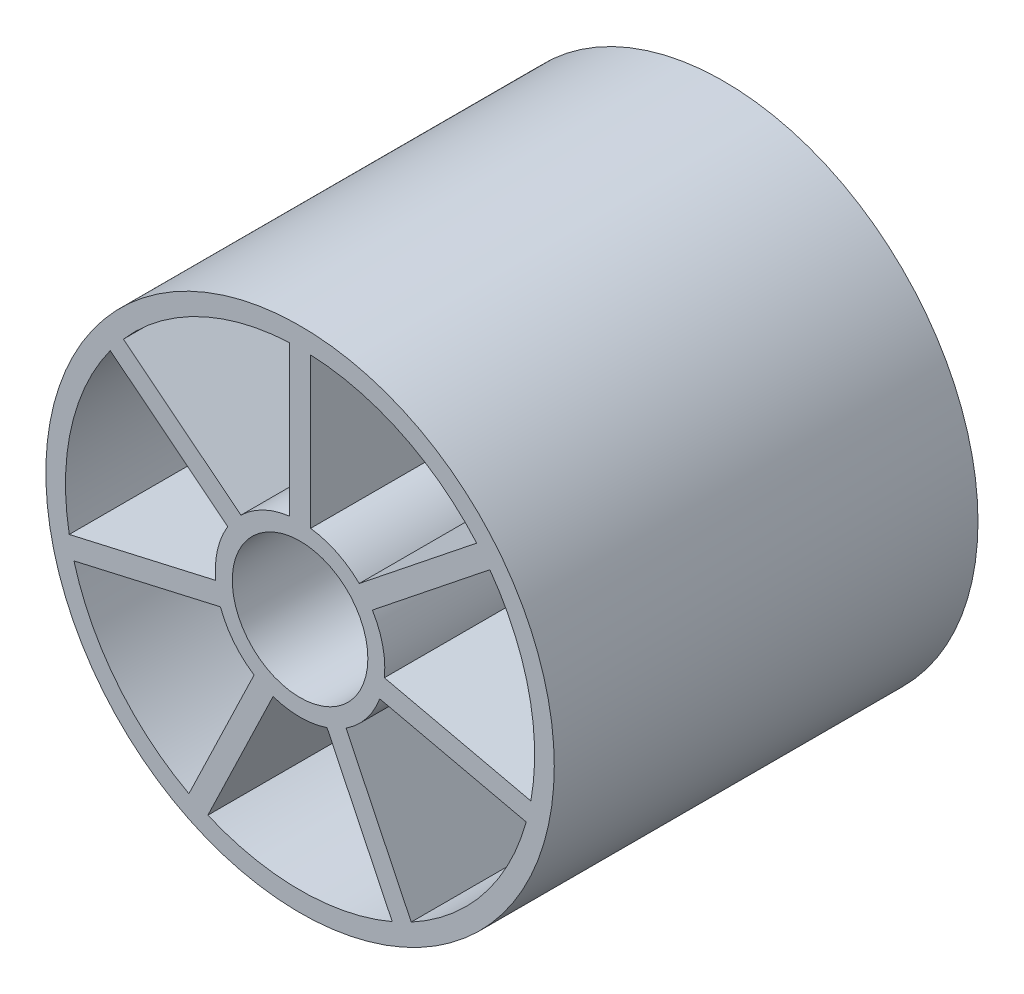
ISO-10303-21;
HEADER;
FILE_DESCRIPTION(('STEP AP214'),'2;1');
FILE_NAME('part.step','',(''),(''),'','','');
FILE_SCHEMA(('AUTOMOTIVE_DESIGN { 1 0 10303 214 1 1 1 1 }'));
ENDSEC;
DATA;
#1=APPLICATION_CONTEXT('core data for automotive mechanical design processes');
#2=APPLICATION_PROTOCOL_DEFINITION('international standard','automotive_design',2000,#1);
#3=PRODUCT_CONTEXT('',#1,'mechanical');
#4=PRODUCT('Part','Part','',(#3));
#5=PRODUCT_RELATED_PRODUCT_CATEGORY('part','',(#4));
#6=PRODUCT_DEFINITION_FORMATION('','',#4);
#7=PRODUCT_DEFINITION_CONTEXT('part definition',#1,'design');
#8=PRODUCT_DEFINITION('design','',#6,#7);
#9=PRODUCT_DEFINITION_SHAPE('','',#8);
#10=(LENGTH_UNIT() NAMED_UNIT(*) SI_UNIT(.MILLI.,.METRE.));
#11=(NAMED_UNIT(*) PLANE_ANGLE_UNIT() SI_UNIT($,.RADIAN.));
#12=(NAMED_UNIT(*) SI_UNIT($,.STERADIAN.) SOLID_ANGLE_UNIT());
#13=UNCERTAINTY_MEASURE_WITH_UNIT(LENGTH_MEASURE(1.E-05),#10,'distance_accuracy_value','');
#14=(GEOMETRIC_REPRESENTATION_CONTEXT(3) GLOBAL_UNCERTAINTY_ASSIGNED_CONTEXT((#13)) GLOBAL_UNIT_ASSIGNED_CONTEXT((#10,
#11,#12)) REPRESENTATION_CONTEXT('',''));
#15=CARTESIAN_POINT('',(0.,0.,0.));
#16=DIRECTION('',(0.,0.,1.));
#17=DIRECTION('',(1.,0.,0.));
#18=AXIS2_PLACEMENT_3D('',#15,#16,#17);
#19=CARTESIAN_POINT('',(0.,0.,25.));
#20=DIRECTION('',(0.,0.,-1.));
#21=DIRECTION('',(-1.,0.,0.));
#22=AXIS2_PLACEMENT_3D('',#19,#20,#21);
#23=CYLINDRICAL_SURFACE('',#22,15.);
#24=CARTESIAN_POINT('',(0.,0.,25.));
#25=DIRECTION('',(0.,0.,1.));
#26=DIRECTION('',(1.,0.,0.));
#27=AXIS2_PLACEMENT_3D('',#24,#25,#26);
#28=CIRCLE('',#27,15.);
#29=CARTESIAN_POINT('',(15.,0.,25.));
#30=VERTEX_POINT('',#29);
#31=EDGE_CURVE('E12',#30,#30,#28,.T.);
#32=ORIENTED_EDGE('',*,*,#31,.F.);
#33=EDGE_LOOP('',(#32));
#34=FACE_BOUND('',#33,.T.);
#35=CARTESIAN_POINT('',(0.,0.,0.));
#36=DIRECTION('',(0.,0.,1.));
#37=DIRECTION('',(1.,0.,0.));
#38=AXIS2_PLACEMENT_3D('',#35,#36,#37);
#39=CIRCLE('',#38,15.);
#40=CARTESIAN_POINT('',(15.,0.,0.));
#41=VERTEX_POINT('',#40);
#42=EDGE_CURVE('E242',#41,#41,#39,.T.);
#43=ORIENTED_EDGE('',*,*,#42,.T.);
#44=EDGE_LOOP('',(#43));
#45=FACE_BOUND('',#44,.T.);
#46=ADVANCED_FACE('F239',(#34,#45),#23,.T.);
#47=CARTESIAN_POINT('',(0.,0.,25.));
#48=DIRECTION('',(0.,0.,1.));
#49=DIRECTION('',(1.,0.,0.));
#50=AXIS2_PLACEMENT_3D('',#47,#48,#49);
#51=PLANE('',#50);
#52=DIRECTION('',(-0.781831482468017,0.62348980185875,0.));
#53=VECTOR('',#52,1.);
#54=CARTESIAN_POINT('',(-0.387507553056566,-0.48591910207764,25.));
#55=LINE('',#54,#53);
#56=CARTESIAN_POINT('',(-4.26634685118294,2.60735201792957,25.));
#57=VERTEX_POINT('',#56);
#58=CARTESIAN_POINT('',(-11.1977085565734,8.13492852669722,25.));
#59=VERTEX_POINT('',#58);
#60=EDGE_CURVE('E253',#57,#59,#55,.T.);
#61=ORIENTED_EDGE('',*,*,#60,.F.);
#62=CARTESIAN_POINT('',(0.,0.,25.));
#63=DIRECTION('',(0.,0.,1.));
#64=DIRECTION('',(1.,0.,0.));
#65=AXIS2_PLACEMENT_3D('',#62,#63,#64);
#66=CIRCLE('',#65,5.);
#67=CARTESIAN_POINT('',(-4.97513333532427,-0.498044471654057,25.));
#68=VERTEX_POINT('',#67);
#69=EDGE_CURVE('E439',#57,#68,#66,.T.);
#70=ORIENTED_EDGE('',*,*,#69,.T.);
#71=DIRECTION('',(-0.974927912181837,-0.222520933956258,0.));
#72=VECTOR('',#71,1.);
#73=CARTESIAN_POINT('',(-0.138299844462643,0.605931209346543,25.));
#74=LINE('',#73,#72);
#75=CARTESIAN_POINT('',(-13.6184000079346,-2.4708136870907,25.));
#76=VERTEX_POINT('',#75);
#77=EDGE_CURVE('E442',#68,#76,#74,.T.);
#78=ORIENTED_EDGE('',*,*,#77,.T.);
#79=CARTESIAN_POINT('',(0.,0.,25.));
#80=DIRECTION('',(0.,0.,1.));
#81=DIRECTION('',(1.,0.,0.));
#82=AXIS2_PLACEMENT_3D('',#79,#80,#81);
#83=CIRCLE('',#82,13.8407275477999);
#84=EDGE_CURVE('E448',#59,#76,#83,.T.);
#85=ORIENTED_EDGE('',*,*,#84,.F.);
#86=EDGE_LOOP('',(#61,#70,#78,#85));
#87=FACE_BOUND('',#86,.T.);
#88=DIRECTION('',(-0.974927912181828,-0.222520933956297,0.));
#89=VECTOR('',#88,1.);
#90=CARTESIAN_POINT('',(0.138299844462895,-0.605931209347535,25.));
#91=LINE('',#90,#89);
#92=CARTESIAN_POINT('',(-4.69853364639857,-1.7099068903483,25.));
#93=VERTEX_POINT('',#92);
#94=CARTESIAN_POINT('',(-13.3418003190089,-3.68267610578532,25.));
#95=VERTEX_POINT('',#94);
#96=EDGE_CURVE('E454',#93,#95,#91,.T.);
#97=ORIENTED_EDGE('',*,*,#96,.F.);
#98=CARTESIAN_POINT('',(0.,0.,25.));
#99=DIRECTION('',(0.,0.,1.));
#100=DIRECTION('',(1.,0.,0.));
#101=AXIS2_PLACEMENT_3D('',#98,#99,#100);
#102=CIRCLE('',#101,5.);
#103=CARTESIAN_POINT('',(-2.71255804985387,-4.20024151998108,25.));
#104=VERTEX_POINT('',#103);
#105=EDGE_CURVE('E462',#93,#104,#102,.T.);
#106=ORIENTED_EDGE('',*,*,#105,.T.);
#107=DIRECTION('',(-0.433883739117625,-0.900968867902387,0.));
#108=VECTOR('',#107,1.);
#109=CARTESIAN_POINT('',(-0.559964638298144,0.269664757234176,25.));
#110=LINE('',#109,#108);
#111=CARTESIAN_POINT('',(-6.55917359469989,-12.1878210032401,25.));
#112=VERTEX_POINT('',#111);
#113=EDGE_CURVE('E475',#104,#112,#110,.T.);
#114=ORIENTED_EDGE('',*,*,#113,.T.);
#115=CARTESIAN_POINT('',(0.,0.,25.));
#116=DIRECTION('',(0.,0.,1.));
#117=DIRECTION('',(1.,0.,0.));
#118=AXIS2_PLACEMENT_3D('',#115,#116,#117);
#119=CIRCLE('',#118,13.8407275477999);
#120=EDGE_CURVE('E472',#95,#112,#119,.T.);
#121=ORIENTED_EDGE('',*,*,#120,.F.);
#122=EDGE_LOOP('',(#97,#106,#114,#121));
#123=FACE_BOUND('',#122,.T.);
#124=DIRECTION('',(-0.433883739117565,-0.900968867902416,0.));
#125=VECTOR('',#124,1.);
#126=CARTESIAN_POINT('',(0.559964638298994,-0.269664757234539,25.));
#127=LINE('',#126,#125);
#128=CARTESIAN_POINT('',(-1.59262877325638,-4.73957103444983,25.));
#129=VERTEX_POINT('',#128);
#130=CARTESIAN_POINT('',(-5.43924431810191,-12.7271505177092,25.));
#131=VERTEX_POINT('',#130);
#132=EDGE_CURVE('E482',#129,#131,#127,.T.);
#133=ORIENTED_EDGE('',*,*,#132,.F.);
#134=CARTESIAN_POINT('',(0.,0.,25.));
#135=DIRECTION('',(0.,0.,1.));
#136=DIRECTION('',(1.,0.,0.));
#137=AXIS2_PLACEMENT_3D('',#134,#135,#136);
#138=CIRCLE('',#137,5.);
#139=CARTESIAN_POINT('',(1.59262877325688,-4.73957103444967,25.));
#140=VERTEX_POINT('',#139);
#141=EDGE_CURVE('E493',#129,#140,#138,.T.);
#142=ORIENTED_EDGE('',*,*,#141,.T.);
#143=DIRECTION('',(0.433883739117492,-0.900968867902451,0.));
#144=VECTOR('',#143,1.);
#145=CARTESIAN_POINT('',(-0.559964638298184,-0.269664757234093,25.));
#146=LINE('',#145,#144);
#147=CARTESIAN_POINT('',(5.43924431810173,-12.7271505177092,25.));
#148=VERTEX_POINT('',#147);
#149=EDGE_CURVE('E506',#140,#148,#146,.T.);
#150=ORIENTED_EDGE('',*,*,#149,.T.);
#151=CARTESIAN_POINT('',(0.,0.,25.));
#152=DIRECTION('',(0.,0.,1.));
#153=DIRECTION('',(1.,0.,0.));
#154=AXIS2_PLACEMENT_3D('',#151,#152,#153);
#155=CIRCLE('',#154,13.8407275477999);
#156=EDGE_CURVE('E503',#131,#148,#155,.T.);
#157=ORIENTED_EDGE('',*,*,#156,.F.);
#158=EDGE_LOOP('',(#133,#142,#150,#157));
#159=FACE_BOUND('',#158,.T.);
#160=DIRECTION('',(0.433883739117545,-0.900968867902425,0.));
#161=VECTOR('',#160,1.);
#162=CARTESIAN_POINT('',(0.559964638299103,0.269664757234576,25.));
#163=LINE('',#162,#161);
#164=CARTESIAN_POINT('',(2.71255804985438,-4.20024151998075,25.));
#165=VERTEX_POINT('',#164);
#166=CARTESIAN_POINT('',(6.55917359469972,-12.1878210032402,25.));
#167=VERTEX_POINT('',#166);
#168=EDGE_CURVE('E513',#165,#167,#163,.T.);
#169=ORIENTED_EDGE('',*,*,#168,.F.);
#170=CARTESIAN_POINT('',(0.,0.,25.));
#171=DIRECTION('',(0.,0.,1.));
#172=DIRECTION('',(1.,0.,0.));
#173=AXIS2_PLACEMENT_3D('',#170,#171,#172);
#174=CIRCLE('',#173,5.);
#175=CARTESIAN_POINT('',(4.69853364639877,-1.70990689034774,25.));
#176=VERTEX_POINT('',#175);
#177=EDGE_CURVE('E524',#165,#176,#174,.T.);
#178=ORIENTED_EDGE('',*,*,#177,.T.);
#179=DIRECTION('',(0.974927912181808,-0.222520933956383,0.));
#180=VECTOR('',#179,1.);
#181=CARTESIAN_POINT('',(-0.138299844462718,-0.605931209346512,25.));
#182=LINE('',#181,#180);
#183=CARTESIAN_POINT('',(13.3418003190089,-3.68267610578549,25.));
#184=VERTEX_POINT('',#183);
#185=EDGE_CURVE('E537',#176,#184,#182,.T.);
#186=ORIENTED_EDGE('',*,*,#185,.T.);
#187=CARTESIAN_POINT('',(0.,0.,25.));
#188=DIRECTION('',(0.,0.,1.));
#189=DIRECTION('',(1.,0.,0.));
#190=AXIS2_PLACEMENT_3D('',#187,#188,#189);
#191=CIRCLE('',#190,13.8407275477999);
#192=EDGE_CURVE('E534',#167,#184,#191,.T.);
#193=ORIENTED_EDGE('',*,*,#192,.F.);
#194=EDGE_LOOP('',(#169,#178,#186,#193));
#195=FACE_BOUND('',#194,.T.);
#196=DIRECTION('',(0.974927912181821,-0.222520933956326,0.));
#197=VECTOR('',#196,1.);
#198=CARTESIAN_POINT('',(0.138299844462914,0.605931209347531,25.));
#199=LINE('',#198,#197);
#200=CARTESIAN_POINT('',(4.97513333532434,-0.498044471653381,25.));
#201=VERTEX_POINT('',#200);
#202=CARTESIAN_POINT('',(13.6184000079346,-2.47081368709065,25.));
#203=VERTEX_POINT('',#202);
#204=EDGE_CURVE('E544',#201,#203,#199,.T.);
#205=ORIENTED_EDGE('',*,*,#204,.F.);
#206=CARTESIAN_POINT('',(0.,0.,25.));
#207=DIRECTION('',(0.,0.,1.));
#208=DIRECTION('',(1.,0.,0.));
#209=AXIS2_PLACEMENT_3D('',#206,#207,#208);
#210=CIRCLE('',#209,5.);
#211=CARTESIAN_POINT('',(4.26634685118265,2.60735201793005,25.));
#212=VERTEX_POINT('',#211);
#213=EDGE_CURVE('E555',#201,#212,#210,.T.);
#214=ORIENTED_EDGE('',*,*,#213,.T.);
#215=DIRECTION('',(0.78183148246807,0.623489801858684,0.));
#216=VECTOR('',#215,1.);
#217=CARTESIAN_POINT('',(0.38750755305592,-0.485919102076914,25.));
#218=LINE('',#217,#216);
#219=CARTESIAN_POINT('',(11.1977085565735,8.13492852669706,25.));
#220=VERTEX_POINT('',#219);
#221=EDGE_CURVE('E568',#212,#220,#218,.T.);
#222=ORIENTED_EDGE('',*,*,#221,.T.);
#223=CARTESIAN_POINT('',(0.,0.,25.));
#224=DIRECTION('',(0.,0.,1.));
#225=DIRECTION('',(1.,0.,0.));
#226=AXIS2_PLACEMENT_3D('',#223,#224,#225);
#227=CIRCLE('',#226,13.8407275477999);
#228=EDGE_CURVE('E565',#203,#220,#227,.T.);
#229=ORIENTED_EDGE('',*,*,#228,.F.);
#230=EDGE_LOOP('',(#205,#214,#222,#229));
#231=FACE_BOUND('',#230,.T.);
#232=DIRECTION('',(0.78183148246803,0.623489801858734,0.));
#233=VECTOR('',#232,1.);
#234=CARTESIAN_POINT('',(-0.387507553056465,0.485919102077533,25.));
#235=LINE('',#234,#233);
#236=CARTESIAN_POINT('',(3.49133174506998,3.57919022208468,25.));
#237=VERTEX_POINT('',#236);
#238=CARTESIAN_POINT('',(10.4226934504605,9.10676673085218,25.));
#239=VERTEX_POINT('',#238);
#240=EDGE_CURVE('E575',#237,#239,#235,.T.);
#241=ORIENTED_EDGE('',*,*,#240,.F.);
#242=CARTESIAN_POINT('',(0.,0.,25.));
#243=DIRECTION('',(0.,0.,1.));
#244=DIRECTION('',(1.,0.,0.));
#245=AXIS2_PLACEMENT_3D('',#242,#243,#244);
#246=CIRCLE('',#245,5.);
#247=CARTESIAN_POINT('',(0.62151385941019,4.96122167641812,25.));
#248=VERTEX_POINT('',#247);
#249=EDGE_CURVE('E586',#237,#248,#246,.T.);
#250=ORIENTED_EDGE('',*,*,#249,.T.);
#251=DIRECTION('',(0.,1.,0.));
#252=VECTOR('',#251,1.);
#253=CARTESIAN_POINT('',(0.621513859409859,0.,25.));
#254=LINE('',#253,#252);
#255=CARTESIAN_POINT('',(0.621513859410783,13.8267660562761,25.));
#256=VERTEX_POINT('',#255);
#257=EDGE_CURVE('E599',#248,#256,#254,.T.);
#258=ORIENTED_EDGE('',*,*,#257,.T.);
#259=CARTESIAN_POINT('',(0.,0.,25.));
#260=DIRECTION('',(0.,0.,1.));
#261=DIRECTION('',(1.,0.,0.));
#262=AXIS2_PLACEMENT_3D('',#259,#260,#261);
#263=CIRCLE('',#262,13.8407275477999);
#264=EDGE_CURVE('E596',#239,#256,#263,.T.);
#265=ORIENTED_EDGE('',*,*,#264,.F.);
#266=EDGE_LOOP('',(#241,#250,#258,#265));
#267=FACE_BOUND('',#266,.T.);
#268=DIRECTION('',(0.,1.,0.));
#269=VECTOR('',#268,1.);
#270=CARTESIAN_POINT('',(-0.621513859410739,0.,25.));
#271=LINE('',#270,#269);
#272=CARTESIAN_POINT('',(-0.621513859410755,4.96122167641805,25.));
#273=VERTEX_POINT('',#272);
#274=CARTESIAN_POINT('',(-0.621513859410783,13.8267660562761,25.));
#275=VERTEX_POINT('',#274);
#276=EDGE_CURVE('E606',#273,#275,#271,.T.);
#277=ORIENTED_EDGE('',*,*,#276,.F.);
#278=CARTESIAN_POINT('',(0.,0.,25.));
#279=DIRECTION('',(0.,0.,1.));
#280=DIRECTION('',(1.,0.,0.));
#281=AXIS2_PLACEMENT_3D('',#278,#279,#280);
#282=CIRCLE('',#281,5.);
#283=CARTESIAN_POINT('',(-3.49133174507033,3.57919022208434,25.));
#284=VERTEX_POINT('',#283);
#285=EDGE_CURVE('E617',#273,#284,#282,.T.);
#286=ORIENTED_EDGE('',*,*,#285,.T.);
#287=DIRECTION('',(-0.781831482467982,0.623489801858794,0.));
#288=VECTOR('',#287,1.);
#289=CARTESIAN_POINT('',(0.387507553055963,0.485919102076826,25.));
#290=LINE('',#289,#288);
#291=CARTESIAN_POINT('',(-10.4226934504604,9.10676673085232,25.));
#292=VERTEX_POINT('',#291);
#293=EDGE_CURVE('E630',#284,#292,#290,.T.);
#294=ORIENTED_EDGE('',*,*,#293,.T.);
#295=CARTESIAN_POINT('',(0.,0.,25.));
#296=DIRECTION('',(0.,0.,1.));
#297=DIRECTION('',(1.,0.,0.));
#298=AXIS2_PLACEMENT_3D('',#295,#296,#297);
#299=CIRCLE('',#298,13.8407275477999);
#300=EDGE_CURVE('E627',#275,#292,#299,.T.);
#301=ORIENTED_EDGE('',*,*,#300,.F.);
#302=EDGE_LOOP('',(#277,#286,#294,#301));
#303=FACE_BOUND('',#302,.T.);
#304=CARTESIAN_POINT('',(0.,0.,25.));
#305=DIRECTION('',(0.,0.,1.));
#306=DIRECTION('',(1.,0.,0.));
#307=AXIS2_PLACEMENT_3D('',#304,#305,#306);
#308=CIRCLE('',#307,4.);
#309=CARTESIAN_POINT('',(4.,0.,25.));
#310=VERTEX_POINT('',#309);
#311=EDGE_CURVE('E637',#310,#310,#308,.T.);
#312=ORIENTED_EDGE('',*,*,#311,.F.);
#313=EDGE_LOOP('',(#312));
#314=FACE_BOUND('',#313,.T.);
#315=ORIENTED_EDGE('',*,*,#31,.T.);
#316=EDGE_LOOP('',(#315));
#317=FACE_BOUND('',#316,.T.);
#318=ADVANCED_FACE('F652',(#87,#123,#159,#195,#231,#267,#303,#314,#317),#51,.T.);
#319=CARTESIAN_POINT('',(0.,0.,0.));
#320=DIRECTION('',(0.,0.,1.));
#321=DIRECTION('',(1.,0.,0.));
#322=AXIS2_PLACEMENT_3D('',#319,#320,#321);
#323=PLANE('',#322);
#324=CARTESIAN_POINT('',(0.,0.,0.));
#325=DIRECTION('',(0.,0.,1.));
#326=DIRECTION('',(1.,0.,0.));
#327=AXIS2_PLACEMENT_3D('',#324,#325,#326);
#328=CIRCLE('',#327,5.);
#329=CARTESIAN_POINT('',(-4.26634685118294,2.60735201792957,0.));
#330=VERTEX_POINT('',#329);
#331=CARTESIAN_POINT('',(-4.97513333532427,-0.498044471654057,0.));
#332=VERTEX_POINT('',#331);
#333=EDGE_CURVE('E428',#330,#332,#328,.T.);
#334=ORIENTED_EDGE('',*,*,#333,.F.);
#335=DIRECTION('',(-0.781831482468017,0.62348980185875,0.));
#336=VECTOR('',#335,1.);
#337=CARTESIAN_POINT('',(-0.387507553056566,-0.48591910207764,0.));
#338=LINE('',#337,#336);
#339=CARTESIAN_POINT('',(-11.1977085565734,8.13492852669722,0.));
#340=VERTEX_POINT('',#339);
#341=EDGE_CURVE('E425',#330,#340,#338,.T.);
#342=ORIENTED_EDGE('',*,*,#341,.T.);
#343=CARTESIAN_POINT('',(0.,0.,0.));
#344=DIRECTION('',(0.,0.,1.));
#345=DIRECTION('',(1.,0.,0.));
#346=AXIS2_PLACEMENT_3D('',#343,#344,#345);
#347=CIRCLE('',#346,13.8407275477999);
#348=CARTESIAN_POINT('',(-13.6184000079346,-2.4708136870907,0.));
#349=VERTEX_POINT('',#348);
#350=EDGE_CURVE('E431',#340,#349,#347,.T.);
#351=ORIENTED_EDGE('',*,*,#350,.T.);
#352=DIRECTION('',(-0.974927912181837,-0.222520933956258,0.));
#353=VECTOR('',#352,1.);
#354=CARTESIAN_POINT('',(-0.138299844462643,0.605931209346543,0.));
#355=LINE('',#354,#353);
#356=EDGE_CURVE('E435',#332,#349,#355,.T.);
#357=ORIENTED_EDGE('',*,*,#356,.F.);
#358=EDGE_LOOP('',(#334,#342,#351,#357));
#359=FACE_BOUND('',#358,.T.);
#360=CARTESIAN_POINT('',(0.,0.,0.));
#361=DIRECTION('',(0.,0.,1.));
#362=DIRECTION('',(1.,0.,0.));
#363=AXIS2_PLACEMENT_3D('',#360,#361,#362);
#364=CIRCLE('',#363,5.);
#365=CARTESIAN_POINT('',(-4.69853364639857,-1.7099068903483,0.));
#366=VERTEX_POINT('',#365);
#367=CARTESIAN_POINT('',(-2.71255804985387,-4.20024151998108,0.));
#368=VERTEX_POINT('',#367);
#369=EDGE_CURVE('E468',#366,#368,#364,.T.);
#370=ORIENTED_EDGE('',*,*,#369,.F.);
#371=DIRECTION('',(-0.974927912181828,-0.222520933956297,0.));
#372=VECTOR('',#371,1.);
#373=CARTESIAN_POINT('',(0.138299844462895,-0.605931209347535,0.));
#374=LINE('',#373,#372);
#375=CARTESIAN_POINT('',(-13.3418003190089,-3.68267610578531,0.));
#376=VERTEX_POINT('',#375);
#377=EDGE_CURVE('E458',#366,#376,#374,.T.);
#378=ORIENTED_EDGE('',*,*,#377,.T.);
#379=CARTESIAN_POINT('',(0.,0.,0.));
#380=DIRECTION('',(0.,0.,1.));
#381=DIRECTION('',(1.,0.,0.));
#382=AXIS2_PLACEMENT_3D('',#379,#380,#381);
#383=CIRCLE('',#382,13.8407275477999);
#384=CARTESIAN_POINT('',(-6.55917359469989,-12.1878210032401,0.));
#385=VERTEX_POINT('',#384);
#386=EDGE_CURVE('E461',#376,#385,#383,.T.);
#387=ORIENTED_EDGE('',*,*,#386,.T.);
#388=DIRECTION('',(-0.433883739117625,-0.900968867902387,0.));
#389=VECTOR('',#388,1.);
#390=CARTESIAN_POINT('',(-0.559964638298144,0.269664757234176,0.));
#391=LINE('',#390,#389);
#392=EDGE_CURVE('E465',#368,#385,#391,.T.);
#393=ORIENTED_EDGE('',*,*,#392,.F.);
#394=EDGE_LOOP('',(#370,#378,#387,#393));
#395=FACE_BOUND('',#394,.T.);
#396=CARTESIAN_POINT('',(0.,0.,0.));
#397=DIRECTION('',(0.,0.,1.));
#398=DIRECTION('',(1.,0.,0.));
#399=AXIS2_PLACEMENT_3D('',#396,#397,#398);
#400=CIRCLE('',#399,5.);
#401=CARTESIAN_POINT('',(-1.59262877325638,-4.73957103444983,0.));
#402=VERTEX_POINT('',#401);
#403=CARTESIAN_POINT('',(1.59262877325688,-4.73957103444967,0.));
#404=VERTEX_POINT('',#403);
#405=EDGE_CURVE('E499',#402,#404,#400,.T.);
#406=ORIENTED_EDGE('',*,*,#405,.F.);
#407=DIRECTION('',(-0.433883739117565,-0.900968867902416,0.));
#408=VECTOR('',#407,1.);
#409=CARTESIAN_POINT('',(0.559964638298994,-0.269664757234539,0.));
#410=LINE('',#409,#408);
#411=CARTESIAN_POINT('',(-5.4392443181019,-12.7271505177092,0.));
#412=VERTEX_POINT('',#411);
#413=EDGE_CURVE('E489',#402,#412,#410,.T.);
#414=ORIENTED_EDGE('',*,*,#413,.T.);
#415=CARTESIAN_POINT('',(0.,0.,0.));
#416=DIRECTION('',(0.,0.,1.));
#417=DIRECTION('',(1.,0.,0.));
#418=AXIS2_PLACEMENT_3D('',#415,#416,#417);
#419=CIRCLE('',#418,13.8407275477999);
#420=CARTESIAN_POINT('',(5.43924431810173,-12.7271505177092,0.));
#421=VERTEX_POINT('',#420);
#422=EDGE_CURVE('E492',#412,#421,#419,.T.);
#423=ORIENTED_EDGE('',*,*,#422,.T.);
#424=DIRECTION('',(0.433883739117492,-0.900968867902451,0.));
#425=VECTOR('',#424,1.);
#426=CARTESIAN_POINT('',(-0.559964638298184,-0.269664757234093,0.));
#427=LINE('',#426,#425);
#428=EDGE_CURVE('E496',#404,#421,#427,.T.);
#429=ORIENTED_EDGE('',*,*,#428,.F.);
#430=EDGE_LOOP('',(#406,#414,#423,#429));
#431=FACE_BOUND('',#430,.T.);
#432=CARTESIAN_POINT('',(0.,0.,0.));
#433=DIRECTION('',(0.,0.,1.));
#434=DIRECTION('',(1.,0.,0.));
#435=AXIS2_PLACEMENT_3D('',#432,#433,#434);
#436=CIRCLE('',#435,5.);
#437=CARTESIAN_POINT('',(2.71255804985438,-4.20024151998075,0.));
#438=VERTEX_POINT('',#437);
#439=CARTESIAN_POINT('',(4.69853364639877,-1.70990689034774,0.));
#440=VERTEX_POINT('',#439);
#441=EDGE_CURVE('E530',#438,#440,#436,.T.);
#442=ORIENTED_EDGE('',*,*,#441,.F.);
#443=DIRECTION('',(0.433883739117545,-0.900968867902425,0.));
#444=VECTOR('',#443,1.);
#445=CARTESIAN_POINT('',(0.559964638299103,0.269664757234576,0.));
#446=LINE('',#445,#444);
#447=CARTESIAN_POINT('',(6.55917359469972,-12.1878210032402,0.));
#448=VERTEX_POINT('',#447);
#449=EDGE_CURVE('E520',#438,#448,#446,.T.);
#450=ORIENTED_EDGE('',*,*,#449,.T.);
#451=CARTESIAN_POINT('',(0.,0.,0.));
#452=DIRECTION('',(0.,0.,1.));
#453=DIRECTION('',(1.,0.,0.));
#454=AXIS2_PLACEMENT_3D('',#451,#452,#453);
#455=CIRCLE('',#454,13.8407275477999);
#456=CARTESIAN_POINT('',(13.3418003190089,-3.6826761057855,0.));
#457=VERTEX_POINT('',#456);
#458=EDGE_CURVE('E523',#448,#457,#455,.T.);
#459=ORIENTED_EDGE('',*,*,#458,.T.);
#460=DIRECTION('',(0.974927912181808,-0.222520933956383,0.));
#461=VECTOR('',#460,1.);
#462=CARTESIAN_POINT('',(-0.138299844462718,-0.605931209346512,0.));
#463=LINE('',#462,#461);
#464=EDGE_CURVE('E527',#440,#457,#463,.T.);
#465=ORIENTED_EDGE('',*,*,#464,.F.);
#466=EDGE_LOOP('',(#442,#450,#459,#465));
#467=FACE_BOUND('',#466,.T.);
#468=CARTESIAN_POINT('',(0.,0.,0.));
#469=DIRECTION('',(0.,0.,1.));
#470=DIRECTION('',(1.,0.,0.));
#471=AXIS2_PLACEMENT_3D('',#468,#469,#470);
#472=CIRCLE('',#471,5.);
#473=CARTESIAN_POINT('',(4.97513333532434,-0.498044471653381,0.));
#474=VERTEX_POINT('',#473);
#475=CARTESIAN_POINT('',(4.26634685118265,2.60735201793005,0.));
#476=VERTEX_POINT('',#475);
#477=EDGE_CURVE('E561',#474,#476,#472,.T.);
#478=ORIENTED_EDGE('',*,*,#477,.F.);
#479=DIRECTION('',(0.974927912181821,-0.222520933956326,0.));
#480=VECTOR('',#479,1.);
#481=CARTESIAN_POINT('',(0.138299844462914,0.605931209347531,0.));
#482=LINE('',#481,#480);
#483=CARTESIAN_POINT('',(13.6184000079346,-2.47081368709065,0.));
#484=VERTEX_POINT('',#483);
#485=EDGE_CURVE('E551',#474,#484,#482,.T.);
#486=ORIENTED_EDGE('',*,*,#485,.T.);
#487=CARTESIAN_POINT('',(0.,0.,0.));
#488=DIRECTION('',(0.,0.,1.));
#489=DIRECTION('',(1.,0.,0.));
#490=AXIS2_PLACEMENT_3D('',#487,#488,#489);
#491=CIRCLE('',#490,13.8407275477999);
#492=CARTESIAN_POINT('',(11.1977085565735,8.13492852669706,0.));
#493=VERTEX_POINT('',#492);
#494=EDGE_CURVE('E554',#484,#493,#491,.T.);
#495=ORIENTED_EDGE('',*,*,#494,.T.);
#496=DIRECTION('',(0.78183148246807,0.623489801858684,0.));
#497=VECTOR('',#496,1.);
#498=CARTESIAN_POINT('',(0.38750755305592,-0.485919102076914,0.));
#499=LINE('',#498,#497);
#500=EDGE_CURVE('E558',#476,#493,#499,.T.);
#501=ORIENTED_EDGE('',*,*,#500,.F.);
#502=EDGE_LOOP('',(#478,#486,#495,#501));
#503=FACE_BOUND('',#502,.T.);
#504=CARTESIAN_POINT('',(0.,0.,0.));
#505=DIRECTION('',(0.,0.,1.));
#506=DIRECTION('',(1.,0.,0.));
#507=AXIS2_PLACEMENT_3D('',#504,#505,#506);
#508=CIRCLE('',#507,5.);
#509=CARTESIAN_POINT('',(3.49133174506998,3.57919022208468,0.));
#510=VERTEX_POINT('',#509);
#511=CARTESIAN_POINT('',(0.62151385941019,4.96122167641812,0.));
#512=VERTEX_POINT('',#511);
#513=EDGE_CURVE('E592',#510,#512,#508,.T.);
#514=ORIENTED_EDGE('',*,*,#513,.F.);
#515=DIRECTION('',(0.78183148246803,0.623489801858734,0.));
#516=VECTOR('',#515,1.);
#517=CARTESIAN_POINT('',(-0.387507553056465,0.485919102077533,0.));
#518=LINE('',#517,#516);
#519=CARTESIAN_POINT('',(10.4226934504605,9.10676673085218,0.));
#520=VERTEX_POINT('',#519);
#521=EDGE_CURVE('E582',#510,#520,#518,.T.);
#522=ORIENTED_EDGE('',*,*,#521,.T.);
#523=CARTESIAN_POINT('',(0.,0.,0.));
#524=DIRECTION('',(0.,0.,1.));
#525=DIRECTION('',(1.,0.,0.));
#526=AXIS2_PLACEMENT_3D('',#523,#524,#525);
#527=CIRCLE('',#526,13.8407275477999);
#528=CARTESIAN_POINT('',(0.621513859410783,13.8267660562761,0.));
#529=VERTEX_POINT('',#528);
#530=EDGE_CURVE('E585',#520,#529,#527,.T.);
#531=ORIENTED_EDGE('',*,*,#530,.T.);
#532=DIRECTION('',(0.,1.,0.));
#533=VECTOR('',#532,1.);
#534=CARTESIAN_POINT('',(0.621513859409859,0.,0.));
#535=LINE('',#534,#533);
#536=EDGE_CURVE('E589',#512,#529,#535,.T.);
#537=ORIENTED_EDGE('',*,*,#536,.F.);
#538=EDGE_LOOP('',(#514,#522,#531,#537));
#539=FACE_BOUND('',#538,.T.);
#540=CARTESIAN_POINT('',(0.,0.,0.));
#541=DIRECTION('',(0.,0.,1.));
#542=DIRECTION('',(1.,0.,0.));
#543=AXIS2_PLACEMENT_3D('',#540,#541,#542);
#544=CIRCLE('',#543,5.);
#545=CARTESIAN_POINT('',(-0.621513859410755,4.96122167641805,0.));
#546=VERTEX_POINT('',#545);
#547=CARTESIAN_POINT('',(-3.49133174507033,3.57919022208434,0.));
#548=VERTEX_POINT('',#547);
#549=EDGE_CURVE('E623',#546,#548,#544,.T.);
#550=ORIENTED_EDGE('',*,*,#549,.F.);
#551=DIRECTION('',(0.,1.,0.));
#552=VECTOR('',#551,1.);
#553=CARTESIAN_POINT('',(-0.621513859410739,0.,0.));
#554=LINE('',#553,#552);
#555=CARTESIAN_POINT('',(-0.621513859410783,13.8267660562761,0.));
#556=VERTEX_POINT('',#555);
#557=EDGE_CURVE('E613',#546,#556,#554,.T.);
#558=ORIENTED_EDGE('',*,*,#557,.T.);
#559=CARTESIAN_POINT('',(0.,0.,0.));
#560=DIRECTION('',(0.,0.,1.));
#561=DIRECTION('',(1.,0.,0.));
#562=AXIS2_PLACEMENT_3D('',#559,#560,#561);
#563=CIRCLE('',#562,13.8407275477999);
#564=CARTESIAN_POINT('',(-10.4226934504604,9.10676673085233,0.));
#565=VERTEX_POINT('',#564);
#566=EDGE_CURVE('E616',#556,#565,#563,.T.);
#567=ORIENTED_EDGE('',*,*,#566,.T.);
#568=DIRECTION('',(-0.781831482467982,0.623489801858794,0.));
#569=VECTOR('',#568,1.);
#570=CARTESIAN_POINT('',(0.387507553055963,0.485919102076826,0.));
#571=LINE('',#570,#569);
#572=EDGE_CURVE('E620',#548,#565,#571,.T.);
#573=ORIENTED_EDGE('',*,*,#572,.F.);
#574=EDGE_LOOP('',(#550,#558,#567,#573));
#575=FACE_BOUND('',#574,.T.);
#576=CARTESIAN_POINT('',(0.,0.,0.));
#577=DIRECTION('',(0.,0.,1.));
#578=DIRECTION('',(1.,0.,0.));
#579=AXIS2_PLACEMENT_3D('',#576,#577,#578);
#580=CIRCLE('',#579,4.);
#581=CARTESIAN_POINT('',(4.,0.,0.));
#582=VERTEX_POINT('',#581);
#583=EDGE_CURVE('E644',#582,#582,#580,.T.);
#584=ORIENTED_EDGE('',*,*,#583,.T.);
#585=EDGE_LOOP('',(#584));
#586=FACE_BOUND('',#585,.T.);
#587=ORIENTED_EDGE('',*,*,#42,.F.);
#588=EDGE_LOOP('',(#587));
#589=FACE_BOUND('',#588,.T.);
#590=ADVANCED_FACE('F437',(#359,#395,#431,#467,#503,#539,#575,#586,#589),#323,.F.);
#591=CARTESIAN_POINT('',(0.,0.,0.));
#592=DIRECTION('',(0.,0.,1.));
#593=DIRECTION('',(1.,0.,0.));
#594=AXIS2_PLACEMENT_3D('',#591,#592,#593);
#595=CYLINDRICAL_SURFACE('',#594,4.);
#596=ORIENTED_EDGE('',*,*,#583,.F.);
#597=EDGE_LOOP('',(#596));
#598=FACE_BOUND('',#597,.T.);
#599=ORIENTED_EDGE('',*,*,#311,.T.);
#600=EDGE_LOOP('',(#599));
#601=FACE_BOUND('',#600,.T.);
#602=ADVANCED_FACE('F650',(#598,#601),#595,.F.);
#603=CARTESIAN_POINT('',(-0.621513859410739,0.,0.));
#604=DIRECTION('',(1.,0.,0.));
#605=DIRECTION('',(0.,1.,0.));
#606=AXIS2_PLACEMENT_3D('',#603,#604,#605);
#607=PLANE('',#606);
#608=ORIENTED_EDGE('',*,*,#276,.T.);
#609=DIRECTION('',(0.,0.,1.));
#610=VECTOR('',#609,1.);
#611=CARTESIAN_POINT('',(-0.621513859410783,13.8267660562761,0.));
#612=LINE('',#611,#610);
#613=EDGE_CURVE('E625',#556,#275,#612,.T.);
#614=ORIENTED_EDGE('',*,*,#613,.F.);
#615=ORIENTED_EDGE('',*,*,#557,.F.);
#616=DIRECTION('',(0.,0.,1.));
#617=VECTOR('',#616,1.);
#618=CARTESIAN_POINT('',(-0.621513859410755,4.96122167641805,0.));
#619=LINE('',#618,#617);
#620=EDGE_CURVE('E635',#546,#273,#619,.T.);
#621=ORIENTED_EDGE('',*,*,#620,.T.);
#622=EDGE_LOOP('',(#608,#614,#615,#621));
#623=FACE_BOUND('',#622,.T.);
#624=ADVANCED_FACE('F668',(#623),#607,.F.);
#625=CARTESIAN_POINT('',(0.,0.,0.));
#626=DIRECTION('',(0.,0.,1.));
#627=DIRECTION('',(1.,0.,0.));
#628=AXIS2_PLACEMENT_3D('',#625,#626,#627);
#629=CYLINDRICAL_SURFACE('',#628,5.);
#630=ORIENTED_EDGE('',*,*,#285,.F.);
#631=ORIENTED_EDGE('',*,*,#620,.F.);
#632=ORIENTED_EDGE('',*,*,#549,.T.);
#633=DIRECTION('',(0.,0.,1.));
#634=VECTOR('',#633,1.);
#635=CARTESIAN_POINT('',(-3.49133174507033,3.57919022208434,0.));
#636=LINE('',#635,#634);
#637=EDGE_CURVE('E638',#548,#284,#636,.T.);
#638=ORIENTED_EDGE('',*,*,#637,.T.);
#639=EDGE_LOOP('',(#630,#631,#632,#638));
#640=FACE_BOUND('',#639,.T.);
#641=ADVANCED_FACE('F674',(#640),#629,.T.);
#642=CARTESIAN_POINT('',(0.387507553055963,0.485919102076826,0.));
#643=DIRECTION('',(0.623489801858794,0.781831482467982,0.));
#644=DIRECTION('',(-0.781831482467982,0.623489801858794,0.));
#645=AXIS2_PLACEMENT_3D('',#642,#643,#644);
#646=PLANE('',#645);
#647=ORIENTED_EDGE('',*,*,#293,.F.);
#648=ORIENTED_EDGE('',*,*,#637,.F.);
#649=ORIENTED_EDGE('',*,*,#572,.T.);
#650=DIRECTION('',(0.,0.,1.));
#651=VECTOR('',#650,1.);
#652=CARTESIAN_POINT('',(-10.4226934504604,9.10676673085232,0.));
#653=LINE('',#652,#651);
#654=EDGE_CURVE('E640',#565,#292,#653,.T.);
#655=ORIENTED_EDGE('',*,*,#654,.T.);
#656=EDGE_LOOP('',(#647,#648,#649,#655));
#657=FACE_BOUND('',#656,.T.);
#658=ADVANCED_FACE('F680',(#657),#646,.T.);
#659=CARTESIAN_POINT('',(0.,0.,0.));
#660=DIRECTION('',(0.,0.,1.));
#661=DIRECTION('',(1.,0.,0.));
#662=AXIS2_PLACEMENT_3D('',#659,#660,#661);
#663=CYLINDRICAL_SURFACE('',#662,13.8407275477999);
#664=ORIENTED_EDGE('',*,*,#300,.T.);
#665=ORIENTED_EDGE('',*,*,#654,.F.);
#666=ORIENTED_EDGE('',*,*,#566,.F.);
#667=ORIENTED_EDGE('',*,*,#613,.T.);
#668=EDGE_LOOP('',(#664,#665,#666,#667));
#669=FACE_BOUND('',#668,.T.);
#670=ADVANCED_FACE('F676',(#669),#663,.F.);
#671=CARTESIAN_POINT('',(-0.387507553056465,0.485919102077533,0.));
#672=DIRECTION('',(0.623489801858734,-0.78183148246803,0.));
#673=DIRECTION('',(0.78183148246803,0.623489801858734,0.));
#674=AXIS2_PLACEMENT_3D('',#671,#672,#673);
#675=PLANE('',#674);
#676=ORIENTED_EDGE('',*,*,#240,.T.);
#677=DIRECTION('',(0.,0.,1.));
#678=VECTOR('',#677,1.);
#679=CARTESIAN_POINT('',(10.4226934504605,9.10676673085218,0.));
#680=LINE('',#679,#678);
#681=EDGE_CURVE('E594',#520,#239,#680,.T.);
#682=ORIENTED_EDGE('',*,*,#681,.F.);
#683=ORIENTED_EDGE('',*,*,#521,.F.);
#684=DIRECTION('',(0.,0.,1.));
#685=VECTOR('',#684,1.);
#686=CARTESIAN_POINT('',(3.49133174506998,3.57919022208468,0.));
#687=LINE('',#686,#685);
#688=EDGE_CURVE('E604',#510,#237,#687,.T.);
#689=ORIENTED_EDGE('',*,*,#688,.T.);
#690=EDGE_LOOP('',(#676,#682,#683,#689));
#691=FACE_BOUND('',#690,.T.);
#692=ADVANCED_FACE('F679',(#691),#675,.F.);
#693=CARTESIAN_POINT('',(0.,0.,0.));
#694=DIRECTION('',(0.,0.,1.));
#695=DIRECTION('',(1.,0.,0.));
#696=AXIS2_PLACEMENT_3D('',#693,#694,#695);
#697=CYLINDRICAL_SURFACE('',#696,5.);
#698=ORIENTED_EDGE('',*,*,#249,.F.);
#699=ORIENTED_EDGE('',*,*,#688,.F.);
#700=ORIENTED_EDGE('',*,*,#513,.T.);
#701=DIRECTION('',(0.,0.,1.));
#702=VECTOR('',#701,1.);
#703=CARTESIAN_POINT('',(0.62151385941019,4.96122167641812,0.));
#704=LINE('',#703,#702);
#705=EDGE_CURVE('E607',#512,#248,#704,.T.);
#706=ORIENTED_EDGE('',*,*,#705,.T.);
#707=EDGE_LOOP('',(#698,#699,#700,#706));
#708=FACE_BOUND('',#707,.T.);
#709=ADVANCED_FACE('F690',(#708),#697,.T.);
#710=CARTESIAN_POINT('',(0.621513859409859,0.,0.));
#711=DIRECTION('',(1.,0.,0.));
#712=DIRECTION('',(0.,1.,0.));
#713=AXIS2_PLACEMENT_3D('',#710,#711,#712);
#714=PLANE('',#713);
#715=ORIENTED_EDGE('',*,*,#257,.F.);
#716=ORIENTED_EDGE('',*,*,#705,.F.);
#717=ORIENTED_EDGE('',*,*,#536,.T.);
#718=DIRECTION('',(0.,0.,1.));
#719=VECTOR('',#718,1.);
#720=CARTESIAN_POINT('',(0.621513859410783,13.8267660562761,0.));
#721=LINE('',#720,#719);
#722=EDGE_CURVE('E609',#529,#256,#721,.T.);
#723=ORIENTED_EDGE('',*,*,#722,.T.);
#724=EDGE_LOOP('',(#715,#716,#717,#723));
#725=FACE_BOUND('',#724,.T.);
#726=ADVANCED_FACE('F696',(#725),#714,.T.);
#727=CARTESIAN_POINT('',(0.,0.,0.));
#728=DIRECTION('',(0.,0.,1.));
#729=DIRECTION('',(1.,0.,0.));
#730=AXIS2_PLACEMENT_3D('',#727,#728,#729);
#731=CYLINDRICAL_SURFACE('',#730,13.8407275477999);
#732=ORIENTED_EDGE('',*,*,#264,.T.);
#733=ORIENTED_EDGE('',*,*,#722,.F.);
#734=ORIENTED_EDGE('',*,*,#530,.F.);
#735=ORIENTED_EDGE('',*,*,#681,.T.);
#736=EDGE_LOOP('',(#732,#733,#734,#735));
#737=FACE_BOUND('',#736,.T.);
#738=ADVANCED_FACE('F692',(#737),#731,.F.);
#739=CARTESIAN_POINT('',(0.138299844462914,0.605931209347531,0.));
#740=DIRECTION('',(-0.222520933956326,-0.974927912181821,0.));
#741=DIRECTION('',(0.974927912181821,-0.222520933956326,0.));
#742=AXIS2_PLACEMENT_3D('',#739,#740,#741);
#743=PLANE('',#742);
#744=ORIENTED_EDGE('',*,*,#204,.T.);
#745=DIRECTION('',(0.,0.,1.));
#746=VECTOR('',#745,1.);
#747=CARTESIAN_POINT('',(13.6184000079346,-2.47081368709065,0.));
#748=LINE('',#747,#746);
#749=EDGE_CURVE('E563',#484,#203,#748,.T.);
#750=ORIENTED_EDGE('',*,*,#749,.F.);
#751=ORIENTED_EDGE('',*,*,#485,.F.);
#752=DIRECTION('',(0.,0.,1.));
#753=VECTOR('',#752,1.);
#754=CARTESIAN_POINT('',(4.97513333532434,-0.498044471653381,0.));
#755=LINE('',#754,#753);
#756=EDGE_CURVE('E573',#474,#201,#755,.T.);
#757=ORIENTED_EDGE('',*,*,#756,.T.);
#758=EDGE_LOOP('',(#744,#750,#751,#757));
#759=FACE_BOUND('',#758,.T.);
#760=ADVANCED_FACE('F695',(#759),#743,.F.);
#761=CARTESIAN_POINT('',(0.,0.,0.));
#762=DIRECTION('',(0.,0.,1.));
#763=DIRECTION('',(1.,0.,0.));
#764=AXIS2_PLACEMENT_3D('',#761,#762,#763);
#765=CYLINDRICAL_SURFACE('',#764,5.);
#766=ORIENTED_EDGE('',*,*,#213,.F.);
#767=ORIENTED_EDGE('',*,*,#756,.F.);
#768=ORIENTED_EDGE('',*,*,#477,.T.);
#769=DIRECTION('',(0.,0.,1.));
#770=VECTOR('',#769,1.);
#771=CARTESIAN_POINT('',(4.26634685118265,2.60735201793005,0.));
#772=LINE('',#771,#770);
#773=EDGE_CURVE('E576',#476,#212,#772,.T.);
#774=ORIENTED_EDGE('',*,*,#773,.T.);
#775=EDGE_LOOP('',(#766,#767,#768,#774));
#776=FACE_BOUND('',#775,.T.);
#777=ADVANCED_FACE('F706',(#776),#765,.T.);
#778=CARTESIAN_POINT('',(0.38750755305592,-0.485919102076914,0.));
#779=DIRECTION('',(0.623489801858683,-0.78183148246807,0.));
#780=DIRECTION('',(0.78183148246807,0.623489801858684,0.));
#781=AXIS2_PLACEMENT_3D('',#778,#779,#780);
#782=PLANE('',#781);
#783=ORIENTED_EDGE('',*,*,#221,.F.);
#784=ORIENTED_EDGE('',*,*,#773,.F.);
#785=ORIENTED_EDGE('',*,*,#500,.T.);
#786=DIRECTION('',(0.,0.,1.));
#787=VECTOR('',#786,1.);
#788=CARTESIAN_POINT('',(11.1977085565735,8.13492852669706,0.));
#789=LINE('',#788,#787);
#790=EDGE_CURVE('E578',#493,#220,#789,.T.);
#791=ORIENTED_EDGE('',*,*,#790,.T.);
#792=EDGE_LOOP('',(#783,#784,#785,#791));
#793=FACE_BOUND('',#792,.T.);
#794=ADVANCED_FACE('F712',(#793),#782,.T.);
#795=CARTESIAN_POINT('',(0.,0.,0.));
#796=DIRECTION('',(0.,0.,1.));
#797=DIRECTION('',(1.,0.,0.));
#798=AXIS2_PLACEMENT_3D('',#795,#796,#797);
#799=CYLINDRICAL_SURFACE('',#798,13.8407275477999);
#800=ORIENTED_EDGE('',*,*,#228,.T.);
#801=ORIENTED_EDGE('',*,*,#790,.F.);
#802=ORIENTED_EDGE('',*,*,#494,.F.);
#803=ORIENTED_EDGE('',*,*,#749,.T.);
#804=EDGE_LOOP('',(#800,#801,#802,#803));
#805=FACE_BOUND('',#804,.T.);
#806=ADVANCED_FACE('F708',(#805),#799,.F.);
#807=CARTESIAN_POINT('',(0.559964638299103,0.269664757234576,0.));
#808=DIRECTION('',(-0.900968867902425,-0.433883739117545,0.));
#809=DIRECTION('',(0.433883739117545,-0.900968867902425,0.));
#810=AXIS2_PLACEMENT_3D('',#807,#808,#809);
#811=PLANE('',#810);
#812=ORIENTED_EDGE('',*,*,#168,.T.);
#813=DIRECTION('',(0.,0.,1.));
#814=VECTOR('',#813,1.);
#815=CARTESIAN_POINT('',(6.55917359469972,-12.1878210032402,0.));
#816=LINE('',#815,#814);
#817=EDGE_CURVE('E532',#448,#167,#816,.T.);
#818=ORIENTED_EDGE('',*,*,#817,.F.);
#819=ORIENTED_EDGE('',*,*,#449,.F.);
#820=DIRECTION('',(0.,0.,1.));
#821=VECTOR('',#820,1.);
#822=CARTESIAN_POINT('',(2.71255804985438,-4.20024151998075,0.));
#823=LINE('',#822,#821);
#824=EDGE_CURVE('E542',#438,#165,#823,.T.);
#825=ORIENTED_EDGE('',*,*,#824,.T.);
#826=EDGE_LOOP('',(#812,#818,#819,#825));
#827=FACE_BOUND('',#826,.T.);
#828=ADVANCED_FACE('F711',(#827),#811,.F.);
#829=CARTESIAN_POINT('',(0.,0.,0.));
#830=DIRECTION('',(0.,0.,1.));
#831=DIRECTION('',(1.,0.,0.));
#832=AXIS2_PLACEMENT_3D('',#829,#830,#831);
#833=CYLINDRICAL_SURFACE('',#832,5.);
#834=ORIENTED_EDGE('',*,*,#177,.F.);
#835=ORIENTED_EDGE('',*,*,#824,.F.);
#836=ORIENTED_EDGE('',*,*,#441,.T.);
#837=DIRECTION('',(0.,0.,1.));
#838=VECTOR('',#837,1.);
#839=CARTESIAN_POINT('',(4.69853364639877,-1.70990689034774,0.));
#840=LINE('',#839,#838);
#841=EDGE_CURVE('E545',#440,#176,#840,.T.);
#842=ORIENTED_EDGE('',*,*,#841,.T.);
#843=EDGE_LOOP('',(#834,#835,#836,#842));
#844=FACE_BOUND('',#843,.T.);
#845=ADVANCED_FACE('F722',(#844),#833,.T.);
#846=CARTESIAN_POINT('',(-0.138299844462718,-0.605931209346512,0.));
#847=DIRECTION('',(-0.222520933956383,-0.974927912181808,0.));
#848=DIRECTION('',(0.974927912181808,-0.222520933956383,0.));
#849=AXIS2_PLACEMENT_3D('',#846,#847,#848);
#850=PLANE('',#849);
#851=ORIENTED_EDGE('',*,*,#185,.F.);
#852=ORIENTED_EDGE('',*,*,#841,.F.);
#853=ORIENTED_EDGE('',*,*,#464,.T.);
#854=DIRECTION('',(0.,0.,1.));
#855=VECTOR('',#854,1.);
#856=CARTESIAN_POINT('',(13.3418003190089,-3.68267610578549,0.));
#857=LINE('',#856,#855);
#858=EDGE_CURVE('E547',#457,#184,#857,.T.);
#859=ORIENTED_EDGE('',*,*,#858,.T.);
#860=EDGE_LOOP('',(#851,#852,#853,#859));
#861=FACE_BOUND('',#860,.T.);
#862=ADVANCED_FACE('F728',(#861),#850,.T.);
#863=CARTESIAN_POINT('',(0.,0.,0.));
#864=DIRECTION('',(0.,0.,1.));
#865=DIRECTION('',(1.,0.,0.));
#866=AXIS2_PLACEMENT_3D('',#863,#864,#865);
#867=CYLINDRICAL_SURFACE('',#866,13.8407275477999);
#868=ORIENTED_EDGE('',*,*,#192,.T.);
#869=ORIENTED_EDGE('',*,*,#858,.F.);
#870=ORIENTED_EDGE('',*,*,#458,.F.);
#871=ORIENTED_EDGE('',*,*,#817,.T.);
#872=EDGE_LOOP('',(#868,#869,#870,#871));
#873=FACE_BOUND('',#872,.T.);
#874=ADVANCED_FACE('F724',(#873),#867,.F.);
#875=CARTESIAN_POINT('',(0.559964638298994,-0.269664757234539,0.));
#876=DIRECTION('',(-0.900968867902416,0.433883739117565,0.));
#877=DIRECTION('',(-0.433883739117565,-0.900968867902416,0.));
#878=AXIS2_PLACEMENT_3D('',#875,#876,#877);
#879=PLANE('',#878);
#880=ORIENTED_EDGE('',*,*,#132,.T.);
#881=DIRECTION('',(0.,0.,1.));
#882=VECTOR('',#881,1.);
#883=CARTESIAN_POINT('',(-5.4392443181019,-12.7271505177092,0.));
#884=LINE('',#883,#882);
#885=EDGE_CURVE('E501',#412,#131,#884,.T.);
#886=ORIENTED_EDGE('',*,*,#885,.F.);
#887=ORIENTED_EDGE('',*,*,#413,.F.);
#888=DIRECTION('',(0.,0.,1.));
#889=VECTOR('',#888,1.);
#890=CARTESIAN_POINT('',(-1.59262877325638,-4.73957103444983,0.));
#891=LINE('',#890,#889);
#892=EDGE_CURVE('E511',#402,#129,#891,.T.);
#893=ORIENTED_EDGE('',*,*,#892,.T.);
#894=EDGE_LOOP('',(#880,#886,#887,#893));
#895=FACE_BOUND('',#894,.T.);
#896=ADVANCED_FACE('F727',(#895),#879,.F.);
#897=CARTESIAN_POINT('',(0.,0.,0.));
#898=DIRECTION('',(0.,0.,1.));
#899=DIRECTION('',(1.,0.,0.));
#900=AXIS2_PLACEMENT_3D('',#897,#898,#899);
#901=CYLINDRICAL_SURFACE('',#900,5.);
#902=ORIENTED_EDGE('',*,*,#141,.F.);
#903=ORIENTED_EDGE('',*,*,#892,.F.);
#904=ORIENTED_EDGE('',*,*,#405,.T.);
#905=DIRECTION('',(0.,0.,1.));
#906=VECTOR('',#905,1.);
#907=CARTESIAN_POINT('',(1.59262877325688,-4.73957103444967,0.));
#908=LINE('',#907,#906);
#909=EDGE_CURVE('E514',#404,#140,#908,.T.);
#910=ORIENTED_EDGE('',*,*,#909,.T.);
#911=EDGE_LOOP('',(#902,#903,#904,#910));
#912=FACE_BOUND('',#911,.T.);
#913=ADVANCED_FACE('F738',(#912),#901,.T.);
#914=CARTESIAN_POINT('',(-0.559964638298184,-0.269664757234093,0.));
#915=DIRECTION('',(-0.900968867902451,-0.433883739117492,0.));
#916=DIRECTION('',(0.433883739117492,-0.900968867902451,0.));
#917=AXIS2_PLACEMENT_3D('',#914,#915,#916);
#918=PLANE('',#917);
#919=ORIENTED_EDGE('',*,*,#149,.F.);
#920=ORIENTED_EDGE('',*,*,#909,.F.);
#921=ORIENTED_EDGE('',*,*,#428,.T.);
#922=DIRECTION('',(0.,0.,1.));
#923=VECTOR('',#922,1.);
#924=CARTESIAN_POINT('',(5.43924431810173,-12.7271505177092,0.));
#925=LINE('',#924,#923);
#926=EDGE_CURVE('E516',#421,#148,#925,.T.);
#927=ORIENTED_EDGE('',*,*,#926,.T.);
#928=EDGE_LOOP('',(#919,#920,#921,#927));
#929=FACE_BOUND('',#928,.T.);
#930=ADVANCED_FACE('F744',(#929),#918,.T.);
#931=CARTESIAN_POINT('',(0.,0.,0.));
#932=DIRECTION('',(0.,0.,1.));
#933=DIRECTION('',(1.,0.,0.));
#934=AXIS2_PLACEMENT_3D('',#931,#932,#933);
#935=CYLINDRICAL_SURFACE('',#934,13.8407275477999);
#936=ORIENTED_EDGE('',*,*,#156,.T.);
#937=ORIENTED_EDGE('',*,*,#926,.F.);
#938=ORIENTED_EDGE('',*,*,#422,.F.);
#939=ORIENTED_EDGE('',*,*,#885,.T.);
#940=EDGE_LOOP('',(#936,#937,#938,#939));
#941=FACE_BOUND('',#940,.T.);
#942=ADVANCED_FACE('F740',(#941),#935,.F.);
#943=CARTESIAN_POINT('',(0.138299844462895,-0.605931209347535,0.));
#944=DIRECTION('',(-0.222520933956297,0.974927912181828,0.));
#945=DIRECTION('',(-0.974927912181828,-0.222520933956297,0.));
#946=AXIS2_PLACEMENT_3D('',#943,#944,#945);
#947=PLANE('',#946);
#948=ORIENTED_EDGE('',*,*,#96,.T.);
#949=DIRECTION('',(0.,0.,1.));
#950=VECTOR('',#949,1.);
#951=CARTESIAN_POINT('',(-13.3418003190089,-3.68267610578531,0.));
#952=LINE('',#951,#950);
#953=EDGE_CURVE('E470',#376,#95,#952,.T.);
#954=ORIENTED_EDGE('',*,*,#953,.F.);
#955=ORIENTED_EDGE('',*,*,#377,.F.);
#956=DIRECTION('',(0.,0.,1.));
#957=VECTOR('',#956,1.);
#958=CARTESIAN_POINT('',(-4.69853364639857,-1.7099068903483,0.));
#959=LINE('',#958,#957);
#960=EDGE_CURVE('E480',#366,#93,#959,.T.);
#961=ORIENTED_EDGE('',*,*,#960,.T.);
#962=EDGE_LOOP('',(#948,#954,#955,#961));
#963=FACE_BOUND('',#962,.T.);
#964=ADVANCED_FACE('F743',(#963),#947,.F.);
#965=CARTESIAN_POINT('',(0.,0.,0.));
#966=DIRECTION('',(0.,0.,1.));
#967=DIRECTION('',(1.,0.,0.));
#968=AXIS2_PLACEMENT_3D('',#965,#966,#967);
#969=CYLINDRICAL_SURFACE('',#968,5.);
#970=ORIENTED_EDGE('',*,*,#105,.F.);
#971=ORIENTED_EDGE('',*,*,#960,.F.);
#972=ORIENTED_EDGE('',*,*,#369,.T.);
#973=DIRECTION('',(0.,0.,1.));
#974=VECTOR('',#973,1.);
#975=CARTESIAN_POINT('',(-2.71255804985387,-4.20024151998108,0.));
#976=LINE('',#975,#974);
#977=EDGE_CURVE('E483',#368,#104,#976,.T.);
#978=ORIENTED_EDGE('',*,*,#977,.T.);
#979=EDGE_LOOP('',(#970,#971,#972,#978));
#980=FACE_BOUND('',#979,.T.);
#981=ADVANCED_FACE('F754',(#980),#969,.T.);
#982=CARTESIAN_POINT('',(-0.559964638298144,0.269664757234176,0.));
#983=DIRECTION('',(-0.900968867902387,0.433883739117625,0.));
#984=DIRECTION('',(-0.433883739117625,-0.900968867902387,0.));
#985=AXIS2_PLACEMENT_3D('',#982,#983,#984);
#986=PLANE('',#985);
#987=ORIENTED_EDGE('',*,*,#113,.F.);
#988=ORIENTED_EDGE('',*,*,#977,.F.);
#989=ORIENTED_EDGE('',*,*,#392,.T.);
#990=DIRECTION('',(0.,0.,1.));
#991=VECTOR('',#990,1.);
#992=CARTESIAN_POINT('',(-6.55917359469989,-12.1878210032401,0.));
#993=LINE('',#992,#991);
#994=EDGE_CURVE('E485',#385,#112,#993,.T.);
#995=ORIENTED_EDGE('',*,*,#994,.T.);
#996=EDGE_LOOP('',(#987,#988,#989,#995));
#997=FACE_BOUND('',#996,.T.);
#998=ADVANCED_FACE('F759',(#997),#986,.T.);
#999=CARTESIAN_POINT('',(0.,0.,0.));
#1000=DIRECTION('',(0.,0.,1.));
#1001=DIRECTION('',(1.,0.,0.));
#1002=AXIS2_PLACEMENT_3D('',#999,#1000,#1001);
#1003=CYLINDRICAL_SURFACE('',#1002,13.8407275477999);
#1004=ORIENTED_EDGE('',*,*,#120,.T.);
#1005=ORIENTED_EDGE('',*,*,#994,.F.);
#1006=ORIENTED_EDGE('',*,*,#386,.F.);
#1007=ORIENTED_EDGE('',*,*,#953,.T.);
#1008=EDGE_LOOP('',(#1004,#1005,#1006,#1007));
#1009=FACE_BOUND('',#1008,.T.);
#1010=ADVANCED_FACE('F756',(#1009),#1003,.F.);
#1011=CARTESIAN_POINT('',(-0.387507553056566,-0.48591910207764,0.));
#1012=DIRECTION('',(0.623489801858749,0.781831482468017,0.));
#1013=DIRECTION('',(-0.781831482468017,0.623489801858749,0.));
#1014=AXIS2_PLACEMENT_3D('',#1011,#1012,#1013);
#1015=PLANE('',#1014);
#1016=ORIENTED_EDGE('',*,*,#60,.T.);
#1017=DIRECTION('',(0.,0.,1.));
#1018=VECTOR('',#1017,1.);
#1019=CARTESIAN_POINT('',(-11.1977085565734,8.13492852669722,0.));
#1020=LINE('',#1019,#1018);
#1021=EDGE_CURVE('E422',#340,#59,#1020,.T.);
#1022=ORIENTED_EDGE('',*,*,#1021,.F.);
#1023=ORIENTED_EDGE('',*,*,#341,.F.);
#1024=DIRECTION('',(0.,0.,1.));
#1025=VECTOR('',#1024,1.);
#1026=CARTESIAN_POINT('',(-4.26634685118294,2.60735201792957,0.));
#1027=LINE('',#1026,#1025);
#1028=EDGE_CURVE('E452',#330,#57,#1027,.T.);
#1029=ORIENTED_EDGE('',*,*,#1028,.T.);
#1030=EDGE_LOOP('',(#1016,#1022,#1023,#1029));
#1031=FACE_BOUND('',#1030,.T.);
#1032=ADVANCED_FACE('F423',(#1031),#1015,.F.);
#1033=CARTESIAN_POINT('',(0.,0.,0.));
#1034=DIRECTION('',(0.,0.,1.));
#1035=DIRECTION('',(1.,0.,0.));
#1036=AXIS2_PLACEMENT_3D('',#1033,#1034,#1035);
#1037=CYLINDRICAL_SURFACE('',#1036,5.);
#1038=ORIENTED_EDGE('',*,*,#69,.F.);
#1039=ORIENTED_EDGE('',*,*,#1028,.F.);
#1040=ORIENTED_EDGE('',*,*,#333,.T.);
#1041=DIRECTION('',(0.,0.,1.));
#1042=VECTOR('',#1041,1.);
#1043=CARTESIAN_POINT('',(-4.97513333532427,-0.498044471654057,0.));
#1044=LINE('',#1043,#1042);
#1045=EDGE_CURVE('E455',#332,#68,#1044,.T.);
#1046=ORIENTED_EDGE('',*,*,#1045,.T.);
#1047=EDGE_LOOP('',(#1038,#1039,#1040,#1046));
#1048=FACE_BOUND('',#1047,.T.);
#1049=ADVANCED_FACE('F769',(#1048),#1037,.T.);
#1050=CARTESIAN_POINT('',(-0.138299844462643,0.605931209346543,0.));
#1051=DIRECTION('',(-0.222520933956258,0.974927912181836,0.));
#1052=DIRECTION('',(-0.974927912181837,-0.222520933956258,0.));
#1053=AXIS2_PLACEMENT_3D('',#1050,#1051,#1052);
#1054=PLANE('',#1053);
#1055=ORIENTED_EDGE('',*,*,#77,.F.);
#1056=ORIENTED_EDGE('',*,*,#1045,.F.);
#1057=ORIENTED_EDGE('',*,*,#356,.T.);
#1058=DIRECTION('',(0.,0.,1.));
#1059=VECTOR('',#1058,1.);
#1060=CARTESIAN_POINT('',(-13.6184000079346,-2.4708136870907,0.));
#1061=LINE('',#1060,#1059);
#1062=EDGE_CURVE('E261',#349,#76,#1061,.T.);
#1063=ORIENTED_EDGE('',*,*,#1062,.T.);
#1064=EDGE_LOOP('',(#1055,#1056,#1057,#1063));
#1065=FACE_BOUND('',#1064,.T.);
#1066=ADVANCED_FACE('F772',(#1065),#1054,.T.);
#1067=CARTESIAN_POINT('',(0.,0.,0.));
#1068=DIRECTION('',(0.,0.,1.));
#1069=DIRECTION('',(1.,0.,0.));
#1070=AXIS2_PLACEMENT_3D('',#1067,#1068,#1069);
#1071=CYLINDRICAL_SURFACE('',#1070,13.8407275477999);
#1072=ORIENTED_EDGE('',*,*,#84,.T.);
#1073=ORIENTED_EDGE('',*,*,#1062,.F.);
#1074=ORIENTED_EDGE('',*,*,#350,.F.);
#1075=ORIENTED_EDGE('',*,*,#1021,.T.);
#1076=EDGE_LOOP('',(#1072,#1073,#1074,#1075));
#1077=FACE_BOUND('',#1076,.T.);
#1078=ADVANCED_FACE('F432',(#1077),#1071,.F.);
#1079=CLOSED_SHELL('',(#46,#318,#590,#602,#624,#641,#658,#670,#692,#709,#726,#738,#760,#777,
#794,#806,#828,#845,#862,#874,#896,#913,#930,#942,#964,#981,#998,#1010,#1032,#1049,#1066,#1078));
#1080=MANIFOLD_SOLID_BREP('B2',#1079);
#1081=ADVANCED_BREP_SHAPE_REPRESENTATION('',(#18,#1080),#14);
#1082=SHAPE_DEFINITION_REPRESENTATION(#9,#1081);
ENDSEC;
END-ISO-10303-21;
